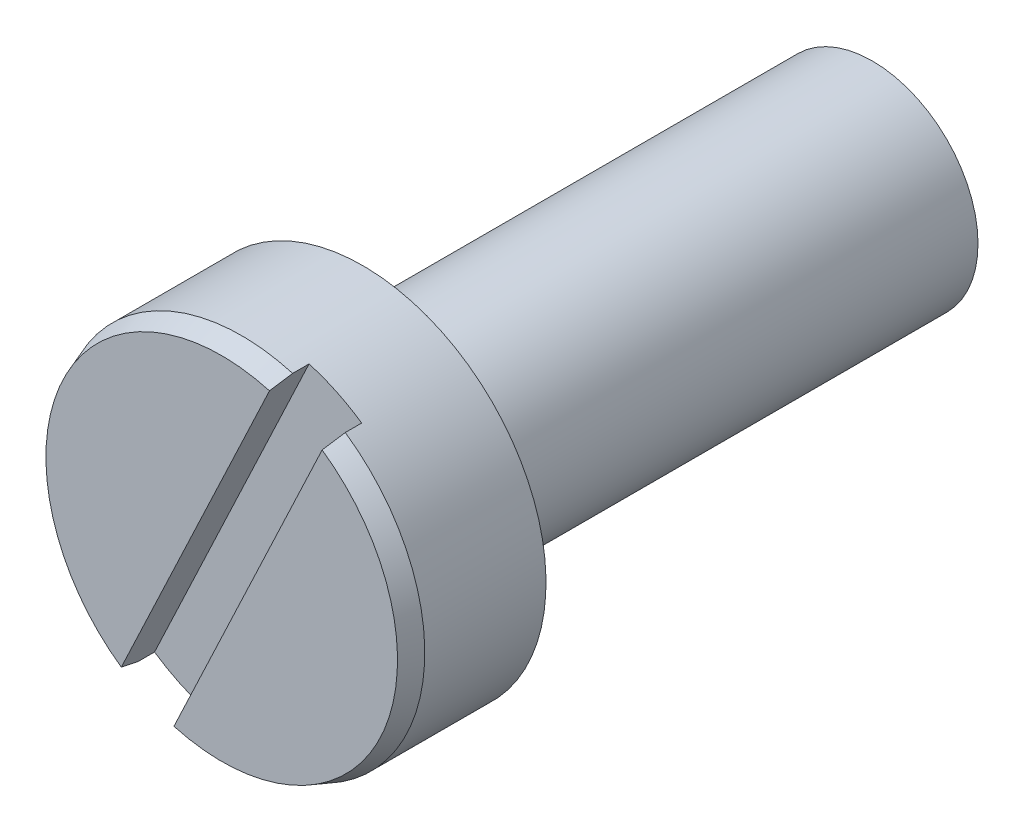
ISO-10303-21;
HEADER;
FILE_DESCRIPTION(('STEP AP214'),'2;1');
FILE_NAME('part.step','',(''),(''),'','','');
FILE_SCHEMA(('AUTOMOTIVE_DESIGN { 1 0 10303 214 1 1 1 1 }'));
ENDSEC;
DATA;
#1=APPLICATION_CONTEXT('core data for automotive mechanical design processes');
#2=APPLICATION_PROTOCOL_DEFINITION('international standard','automotive_design',2000,#1);
#3=PRODUCT_CONTEXT('',#1,'mechanical');
#4=PRODUCT('Part','Part','',(#3));
#5=PRODUCT_RELATED_PRODUCT_CATEGORY('part','',(#4));
#6=PRODUCT_DEFINITION_FORMATION('','',#4);
#7=PRODUCT_DEFINITION_CONTEXT('part definition',#1,'design');
#8=PRODUCT_DEFINITION('design','',#6,#7);
#9=PRODUCT_DEFINITION_SHAPE('','',#8);
#10=(LENGTH_UNIT() NAMED_UNIT(*) SI_UNIT(.MILLI.,.METRE.));
#11=(NAMED_UNIT(*) PLANE_ANGLE_UNIT() SI_UNIT($,.RADIAN.));
#12=(NAMED_UNIT(*) SI_UNIT($,.STERADIAN.) SOLID_ANGLE_UNIT());
#13=UNCERTAINTY_MEASURE_WITH_UNIT(LENGTH_MEASURE(1.E-05),#10,'distance_accuracy_value','');
#14=(GEOMETRIC_REPRESENTATION_CONTEXT(3) GLOBAL_UNCERTAINTY_ASSIGNED_CONTEXT((#13)) GLOBAL_UNIT_ASSIGNED_CONTEXT((#10,
#11,#12)) REPRESENTATION_CONTEXT('',''));
#15=CARTESIAN_POINT('',(0.,0.,0.));
#16=DIRECTION('',(0.,0.,1.));
#17=DIRECTION('',(1.,0.,0.));
#18=AXIS2_PLACEMENT_3D('',#15,#16,#17);
#19=CARTESIAN_POINT('',(-7.60780190320781,-23.3190340135455,19.8));
#20=DIRECTION('',(0.,0.,-1.));
#21=DIRECTION('',(0.427457329703379,0.904035525453982,0.));
#22=AXIS2_PLACEMENT_3D('',#19,#20,#21);
#23=TOROIDAL_SURFACE('',#22,1.95,0.5);
#24=CARTESIAN_POINT('',(-7.60780190320781,-23.3190340135455,19.8));
#25=DIRECTION('',(0.,0.,-1.));
#26=DIRECTION('',(0.427457329703379,0.904035525453982,0.));
#27=AXIS2_PLACEMENT_3D('',#24,#25,#26);
#28=CIRCLE('',#27,1.45);
#29=CARTESIAN_POINT('',(-6.98798877513791,-22.0081825016372,19.8));
#30=VERTEX_POINT('',#29);
#31=EDGE_CURVE('E11',#30,#30,#28,.T.);
#32=ORIENTED_EDGE('',*,*,#31,.F.);
#33=EDGE_LOOP('',(#32));
#34=FACE_BOUND('',#33,.T.);
#35=CARTESIAN_POINT('',(-7.60780190320781,-23.3190340135448,20.3));
#36=DIRECTION('',(0.,0.,1.));
#37=DIRECTION('',(0.427457329703379,0.904035525453982,0.));
#38=AXIS2_PLACEMENT_3D('',#35,#36,#37);
#39=CIRCLE('',#38,1.95);
#40=CARTESIAN_POINT('',(-6.77426011028622,-21.5561647389095,20.3));
#41=VERTEX_POINT('',#40);
#42=EDGE_CURVE('E125',#41,#41,#39,.T.);
#43=ORIENTED_EDGE('',*,*,#42,.F.);
#44=EDGE_LOOP('',(#43));
#45=FACE_BOUND('',#44,.T.);
#46=ADVANCED_FACE('F17',(#34,#45),#23,.F.);
#47=CARTESIAN_POINT('',(-7.60780190320781,-23.3190340135446,13.3000000000002));
#48=DIRECTION('',(0.,0.,1.));
#49=DIRECTION('',(-0.427457329703379,-0.904035525453982,0.));
#50=AXIS2_PLACEMENT_3D('',#47,#48,#49);
#51=CONICAL_SURFACE('',#50,1.175252258055,1.221730476396);
#52=CARTESIAN_POINT('',(-7.60780190320781,-23.3190340135446,13.3000000000002));
#53=DIRECTION('',(0.,0.,-1.));
#54=DIRECTION('',(0.427457329703379,0.904035525453982,0.));
#55=AXIS2_PLACEMENT_3D('',#52,#53,#54);
#56=CIRCLE('',#55,1.175252258055);
#57=CARTESIAN_POINT('',(-7.10543171125175,-22.2565642208929,13.3000000000002));
#58=VERTEX_POINT('',#57);
#59=EDGE_CURVE('E110',#58,#58,#56,.T.);
#60=ORIENTED_EDGE('',*,*,#59,.F.);
#61=EDGE_LOOP('',(#60));
#62=FACE_BOUND('',#61,.T.);
#63=CARTESIAN_POINT('',(-7.60780190320781,-23.3190340135455,13.4000000000002));
#64=DIRECTION('',(0.,0.,1.));
#65=DIRECTION('',(0.427457329703379,0.904035525453982,0.));
#66=AXIS2_PLACEMENT_3D('',#63,#64,#65);
#67=CIRCLE('',#66,1.45);
#68=CARTESIAN_POINT('',(-6.98798877513791,-22.0081825016372,13.4000000000002));
#69=VERTEX_POINT('',#68);
#70=EDGE_CURVE('E26',#69,#69,#67,.T.);
#71=ORIENTED_EDGE('',*,*,#70,.F.);
#72=EDGE_LOOP('',(#71));
#73=FACE_BOUND('',#72,.T.);
#74=ADVANCED_FACE('F181',(#62,#73),#51,.T.);
#75=CARTESIAN_POINT('',(-7.60780190320781,-23.3190340135448,20.3));
#76=DIRECTION('',(0.,0.,1.));
#77=DIRECTION('',(-0.427457329703379,-0.904035525453982,0.));
#78=AXIS2_PLACEMENT_3D('',#75,#76,#77);
#79=CONICAL_SURFACE('',#78,2.240252258055,1.221730476396);
#80=CARTESIAN_POINT('',(-7.60780190320781,-23.3190340135448,20.3));
#81=DIRECTION('',(0.,0.,-1.));
#82=DIRECTION('',(0.427457329703379,0.904035525453982,0.));
#83=AXIS2_PLACEMENT_3D('',#80,#81,#82);
#84=CIRCLE('',#83,2.240252258055);
#85=CARTESIAN_POINT('',(-6.65018965511765,-21.2937663862846,20.3));
#86=VERTEX_POINT('',#85);
#87=EDGE_CURVE('E121',#86,#86,#84,.T.);
#88=ORIENTED_EDGE('',*,*,#87,.F.);
#89=EDGE_LOOP('',(#88));
#90=FACE_BOUND('',#89,.T.);
#91=CARTESIAN_POINT('',(-7.60780190320781,-23.3190340135447,20.4));
#92=DIRECTION('',(0.,0.,1.));
#93=DIRECTION('',(0.427457329703379,0.904035525453982,0.));
#94=AXIS2_PLACEMENT_3D('',#91,#92,#93);
#95=CIRCLE('',#94,2.515);
#96=CARTESIAN_POINT('',(-6.53274671900381,-21.0453846670279,20.4));
#97=VERTEX_POINT('',#96);
#98=EDGE_CURVE('E68',#97,#97,#95,.T.);
#99=ORIENTED_EDGE('',*,*,#98,.F.);
#100=EDGE_LOOP('',(#99));
#101=FACE_BOUND('',#100,.T.);
#102=ADVANCED_FACE('F186',(#90,#101),#79,.T.);
#103=CARTESIAN_POINT('',(-7.60780190320781,-23.3190340135446,13.3000000000002));
#104=DIRECTION('',(0.,0.,-1.));
#105=DIRECTION('',(0.427457329703379,0.904035525453982,0.));
#106=AXIS2_PLACEMENT_3D('',#103,#104,#105);
#107=CYLINDRICAL_SURFACE('',#106,1.45);
#108=ORIENTED_EDGE('',*,*,#31,.T.);
#109=EDGE_LOOP('',(#108));
#110=FACE_BOUND('',#109,.T.);
#111=ORIENTED_EDGE('',*,*,#70,.T.);
#112=EDGE_LOOP('',(#111));
#113=FACE_BOUND('',#112,.T.);
#114=ADVANCED_FACE('F174',(#110,#113),#107,.T.);
#115=CARTESIAN_POINT('',(-7.60780190320781,-23.3190340135446,13.3000000000002));
#116=DIRECTION('',(0.,0.,-1.));
#117=DIRECTION('',(0.427457329703379,0.904035525453982,0.));
#118=AXIS2_PLACEMENT_3D('',#115,#116,#117);
#119=CYLINDRICAL_SURFACE('',#118,2.515);
#120=CARTESIAN_POINT('',(-7.60780190320781,-23.3190340135453,21.84));
#121=DIRECTION('',(0.,0.,-1.));
#122=DIRECTION('',(-0.427457329703369,-0.904035525453986,0.));
#123=AXIS2_PLACEMENT_3D('',#120,#121,#122);
#124=CIRCLE('',#123,2.515);
#125=CARTESIAN_POINT('',(-8.30755873375082,-25.7347255042179,21.8400000000003));
#126=VERTEX_POINT('',#125);
#127=CARTESIAN_POINT('',(-9.03078715411382,-25.3927596404552,21.8400000000002));
#128=VERTEX_POINT('',#127);
#129=EDGE_CURVE('E145',#126,#128,#124,.T.);
#130=ORIENTED_EDGE('',*,*,#129,.T.);
#131=DIRECTION('',(0.,0.,-1.));
#132=VECTOR('',#131,1.);
#133=CARTESIAN_POINT('',(-9.03078715411382,-25.3927596404552,13.3000000000002));
#134=LINE('',#133,#132);
#135=CARTESIAN_POINT('',(-9.03078715411382,-25.3927596404552,22.0652522580553));
#136=VERTEX_POINT('',#135);
#137=EDGE_CURVE('E64',#136,#128,#134,.T.);
#138=ORIENTED_EDGE('',*,*,#137,.F.);
#139=CARTESIAN_POINT('',(-7.60780190320781,-23.3190340135451,22.0652522580552));
#140=DIRECTION('',(0.,0.,-1.));
#141=DIRECTION('',(-0.427457329703379,-0.904035525453982,0.));
#142=AXIS2_PLACEMENT_3D('',#139,#140,#141);
#143=CIRCLE('',#142,2.515);
#144=CARTESIAN_POINT('',(-6.90804507266379,-20.9033425228722,22.0652522580553));
#145=VERTEX_POINT('',#144);
#146=EDGE_CURVE('E53',#136,#145,#143,.T.);
#147=ORIENTED_EDGE('',*,*,#146,.T.);
#148=DIRECTION('',(0.,0.,1.));
#149=VECTOR('',#148,1.);
#150=CARTESIAN_POINT('',(-6.90804507266379,-20.9033425228717,13.3000000000002));
#151=LINE('',#150,#149);
#152=CARTESIAN_POINT('',(-6.90804507266379,-20.9033425228723,21.8400000000002));
#153=VERTEX_POINT('',#152);
#154=EDGE_CURVE('E61',#153,#145,#151,.T.);
#155=ORIENTED_EDGE('',*,*,#154,.F.);
#156=CARTESIAN_POINT('',(-7.60780190320781,-23.3190340135453,21.84));
#157=DIRECTION('',(0.,0.,-1.));
#158=DIRECTION('',(-0.427457329703379,-0.904035525453982,0.));
#159=AXIS2_PLACEMENT_3D('',#156,#157,#158);
#160=CIRCLE('',#159,2.515);
#161=CARTESIAN_POINT('',(-6.18481665230081,-21.2453083866353,21.8400000000002));
#162=VERTEX_POINT('',#161);
#163=EDGE_CURVE('E93',#153,#162,#160,.T.);
#164=ORIENTED_EDGE('',*,*,#163,.T.);
#165=DIRECTION('',(0.,0.,-1.));
#166=VECTOR('',#165,1.);
#167=CARTESIAN_POINT('',(-6.18481665230081,-21.2453083866347,13.3000000000002));
#168=LINE('',#167,#166);
#169=CARTESIAN_POINT('',(-6.18481665230081,-21.2453083866352,22.0652522580553));
#170=VERTEX_POINT('',#169);
#171=EDGE_CURVE('E96',#170,#162,#168,.T.);
#172=ORIENTED_EDGE('',*,*,#171,.F.);
#173=CARTESIAN_POINT('',(-8.30755873375082,-25.7347255042179,22.0652522580553));
#174=VERTEX_POINT('',#173);
#175=EDGE_CURVE('E106',#170,#174,#143,.T.);
#176=ORIENTED_EDGE('',*,*,#175,.T.);
#177=DIRECTION('',(0.,0.,1.));
#178=VECTOR('',#177,1.);
#179=CARTESIAN_POINT('',(-8.30755873375082,-25.7347255042179,13.3000000000002));
#180=LINE('',#179,#178);
#181=EDGE_CURVE('E103',#126,#174,#180,.T.);
#182=ORIENTED_EDGE('',*,*,#181,.F.);
#183=EDGE_LOOP('',(#130,#138,#147,#155,#164,#172,#176,#182));
#184=FACE_BOUND('',#183,.T.);
#185=ORIENTED_EDGE('',*,*,#98,.T.);
#186=EDGE_LOOP('',(#185));
#187=FACE_BOUND('',#186,.T.);
#188=ADVANCED_FACE('F56',(#184,#187),#119,.T.);
#189=CARTESIAN_POINT('',(-7.60780190320781,-23.3190340135456,22.34));
#190=DIRECTION('',(0.,0.,1.));
#191=DIRECTION('',(-0.427457329703379,-0.904035525453982,0.));
#192=AXIS2_PLACEMENT_3D('',#189,#190,#191);
#193=PLANE('',#192);
#194=DIRECTION('',(-0.427457329703379,-0.904035525453982,0.));
#195=VECTOR('',#194,1.);
#196=CARTESIAN_POINT('',(-9.26726577789182,-25.8928916116494,22.3400000000002));
#197=LINE('',#196,#195);
#198=CARTESIAN_POINT('',(-6.95136521087381,-20.9949608931466,22.3400000000003));
#199=VERTEX_POINT('',#198);
#200=CARTESIAN_POINT('',(-8.98746701590382,-25.3011412701808,22.34));
#201=VERTEX_POINT('',#200);
#202=EDGE_CURVE('E76',#199,#201,#197,.T.);
#203=ORIENTED_EDGE('',*,*,#202,.F.);
#204=CARTESIAN_POINT('',(-7.60780190320781,-23.3190340135456,22.34));
#205=DIRECTION('',(0.,0.,1.));
#206=DIRECTION('',(-0.427457329703379,-0.904035525453982,0.));
#207=AXIS2_PLACEMENT_3D('',#204,#205,#206);
#208=CIRCLE('',#207,2.415);
#209=EDGE_CURVE('E36',#199,#201,#208,.T.);
#210=ORIENTED_EDGE('',*,*,#209,.T.);
#211=EDGE_LOOP('',(#203,#210));
#212=FACE_BOUND('',#211,.T.);
#213=ADVANCED_FACE('F163',(#212),#193,.T.);
#214=CARTESIAN_POINT('',(-7.60780190320781,-23.3190340135451,22.0652522580552));
#215=DIRECTION('',(0.,0.,-1.));
#216=DIRECTION('',(0.427457329703379,0.904035525453982,0.));
#217=AXIS2_PLACEMENT_3D('',#214,#215,#216);
#218=CONICAL_SURFACE('',#217,2.515,0.349065850399);
#219=CARTESIAN_POINT('',(319.637732713186,669.712920875446,-261.393080578831));
#220=DIRECTION('',(0.904035525452299,-0.427457329706938,1.46077674032882E-12));
#221=DIRECTION('',(-0.401017918661995,-0.848118442749434,0.346236531839547));
#222=AXIS2_PLACEMENT_3D('',#219,#220,#221);
#223=CIRCLE('',#222,819.477595478914);
#224=EDGE_CURVE('E153',#201,#136,#223,.T.);
#225=ORIENTED_EDGE('',*,*,#224,.F.);
#226=ORIENTED_EDGE('',*,*,#209,.F.);
#227=CARTESIAN_POINT('',(-335.576562303542,-716.009017471019,-261.3930783065));
#228=DIRECTION('',(0.904035525453982,-0.427457329703379,0.));
#229=DIRECTION('',(0.401070781773213,0.848230243697522,0.345901260021795));
#230=AXIS2_PLACEMENT_3D('',#227,#228,#229);
#231=CIRCLE('',#230,819.477588912782);
#232=EDGE_CURVE('E71',#145,#199,#231,.T.);
#233=ORIENTED_EDGE('',*,*,#232,.F.);
#234=ORIENTED_EDGE('',*,*,#146,.F.);
#235=EDGE_LOOP('',(#225,#226,#233,#234));
#236=FACE_BOUND('',#235,.T.);
#237=ADVANCED_FACE('F72',(#236),#218,.T.);
#238=DIRECTION('',(0.427457329703379,0.904035525453982,0.));
#239=VECTOR('',#238,1.);
#240=CARTESIAN_POINT('',(-8.54403735752882,-26.2348574754121,22.34));
#241=LINE('',#240,#239);
#242=CARTESIAN_POINT('',(-8.26423859554082,-25.6431071339434,22.34));
#243=VERTEX_POINT('',#242);
#244=CARTESIAN_POINT('',(-6.22813679051082,-21.3369267569095,22.3400000000003));
#245=VERTEX_POINT('',#244);
#246=EDGE_CURVE('E246',#243,#245,#241,.T.);
#247=ORIENTED_EDGE('',*,*,#246,.F.);
#248=EDGE_CURVE('E111',#243,#245,#208,.T.);
#249=ORIENTED_EDGE('',*,*,#248,.T.);
#250=EDGE_LOOP('',(#247,#249));
#251=FACE_BOUND('',#250,.T.);
#252=ADVANCED_FACE('F166',(#251),#193,.T.);
#253=CARTESIAN_POINT('',(-5.33415255669081,-24.3940891977488,20.3000000000003));
#254=DIRECTION('',(0.,0.,-1.));
#255=DIRECTION('',(0.427457329703379,0.904035525453982,0.));
#256=AXIS2_PLACEMENT_3D('',#253,#254,#255);
#257=PLANE('',#256);
#258=ORIENTED_EDGE('',*,*,#42,.T.);
#259=EDGE_LOOP('',(#258));
#260=FACE_BOUND('',#259,.T.);
#261=ORIENTED_EDGE('',*,*,#87,.T.);
#262=EDGE_LOOP('',(#261));
#263=FACE_BOUND('',#262,.T.);
#264=ADVANCED_FACE('F178',(#260,#263),#257,.T.);
#265=CARTESIAN_POINT('',(-6.29695039129882,-23.9388471416146,13.3000000000002));
#266=DIRECTION('',(0.,0.,-1.));
#267=DIRECTION('',(0.427457329703379,0.904035525453982,0.));
#268=AXIS2_PLACEMENT_3D('',#265,#266,#267);
#269=PLANE('',#268);
#270=ORIENTED_EDGE('',*,*,#59,.T.);
#271=EDGE_LOOP('',(#270));
#272=FACE_BOUND('',#271,.T.);
#273=ADVANCED_FACE('F208',(#272),#269,.T.);
#274=CARTESIAN_POINT('',(-334.853336519594,-716.350988902531,-261.393080578849));
#275=DIRECTION('',(-0.904035525452299,0.427457329706938,1.44341947337369E-12));
#276=DIRECTION('',(0.401017918661986,0.848118442749428,0.346236531839572));
#277=AXIS2_PLACEMENT_3D('',#274,#275,#276);
#278=CIRCLE('',#277,819.477595478914);
#279=EDGE_CURVE('E86',#245,#170,#278,.T.);
#280=ORIENTED_EDGE('',*,*,#279,.F.);
#281=ORIENTED_EDGE('',*,*,#248,.F.);
#282=CARTESIAN_POINT('',(320.360958497134,669.370949443934,-261.39307830648));
#283=DIRECTION('',(-0.904035525453982,0.427457329703379,0.));
#284=DIRECTION('',(-0.401070781773222,-0.848230243697527,0.345901260021773));
#285=AXIS2_PLACEMENT_3D('',#282,#283,#284);
#286=CIRCLE('',#285,819.477588912782);
#287=EDGE_CURVE('E115',#174,#243,#286,.T.);
#288=ORIENTED_EDGE('',*,*,#287,.F.);
#289=ORIENTED_EDGE('',*,*,#175,.F.);
#290=EDGE_LOOP('',(#280,#281,#288,#289));
#291=FACE_BOUND('',#290,.T.);
#292=ADVANCED_FACE('F173',(#291),#218,.T.);
#293=CARTESIAN_POINT('',(-9.26726577789182,-25.8928916116494,21.8400000000002));
#294=DIRECTION('',(-0.904035525453982,0.427457329703379,0.));
#295=DIRECTION('',(-0.427457329703379,-0.904035525453982,0.));
#296=AXIS2_PLACEMENT_3D('',#293,#294,#295);
#297=PLANE('',#296);
#298=ORIENTED_EDGE('',*,*,#137,.T.);
#299=DIRECTION('',(-0.427457329703379,-0.904035525453982,0.));
#300=VECTOR('',#299,1.);
#301=CARTESIAN_POINT('',(-9.26726577789182,-25.8928916116494,21.8400000000002));
#302=LINE('',#301,#300);
#303=EDGE_CURVE('E81',#153,#128,#302,.T.);
#304=ORIENTED_EDGE('',*,*,#303,.F.);
#305=ORIENTED_EDGE('',*,*,#154,.T.);
#306=ORIENTED_EDGE('',*,*,#232,.T.);
#307=ORIENTED_EDGE('',*,*,#202,.T.);
#308=ORIENTED_EDGE('',*,*,#224,.T.);
#309=EDGE_LOOP('',(#298,#304,#305,#306,#307,#308));
#310=FACE_BOUND('',#309,.T.);
#311=ADVANCED_FACE('F79',(#310),#297,.F.);
#312=CARTESIAN_POINT('',(-8.54403735752882,-26.2348574754121,21.84));
#313=DIRECTION('',(0.904035525453982,-0.427457329703379,0.));
#314=DIRECTION('',(0.427457329703379,0.904035525453982,0.));
#315=AXIS2_PLACEMENT_3D('',#312,#313,#314);
#316=PLANE('',#315);
#317=ORIENTED_EDGE('',*,*,#171,.T.);
#318=DIRECTION('',(0.427457329703379,0.904035525453982,0.));
#319=VECTOR('',#318,1.);
#320=CARTESIAN_POINT('',(-8.54403735752882,-26.2348574754121,21.84));
#321=LINE('',#320,#319);
#322=EDGE_CURVE('E97',#126,#162,#321,.T.);
#323=ORIENTED_EDGE('',*,*,#322,.F.);
#324=ORIENTED_EDGE('',*,*,#181,.T.);
#325=ORIENTED_EDGE('',*,*,#287,.T.);
#326=ORIENTED_EDGE('',*,*,#246,.T.);
#327=ORIENTED_EDGE('',*,*,#279,.T.);
#328=EDGE_LOOP('',(#317,#323,#324,#325,#326,#327));
#329=FACE_BOUND('',#328,.T.);
#330=ADVANCED_FACE('F217',(#329),#316,.F.);
#331=CARTESIAN_POINT('',(-7.60780190320781,-23.3190340135453,21.84));
#332=DIRECTION('',(0.,0.,1.));
#333=DIRECTION('',(-0.427457329703379,-0.904035525453982,0.));
#334=AXIS2_PLACEMENT_3D('',#331,#332,#333);
#335=PLANE('',#334);
#336=ORIENTED_EDGE('',*,*,#303,.T.);
#337=ORIENTED_EDGE('',*,*,#129,.F.);
#338=ORIENTED_EDGE('',*,*,#322,.T.);
#339=ORIENTED_EDGE('',*,*,#163,.F.);
#340=EDGE_LOOP('',(#336,#337,#338,#339));
#341=FACE_BOUND('',#340,.T.);
#342=ADVANCED_FACE('F220',(#341),#335,.T.);
#343=CLOSED_SHELL('',(#46,#74,#102,#114,#188,#213,#237,#252,#264,#273,#292,#311,#330,#342));
#344=MANIFOLD_SOLID_BREP('B1',#343);
#345=ADVANCED_BREP_SHAPE_REPRESENTATION('',(#18,#344),#14);
#346=SHAPE_DEFINITION_REPRESENTATION(#9,#345);
ENDSEC;
END-ISO-10303-21;
